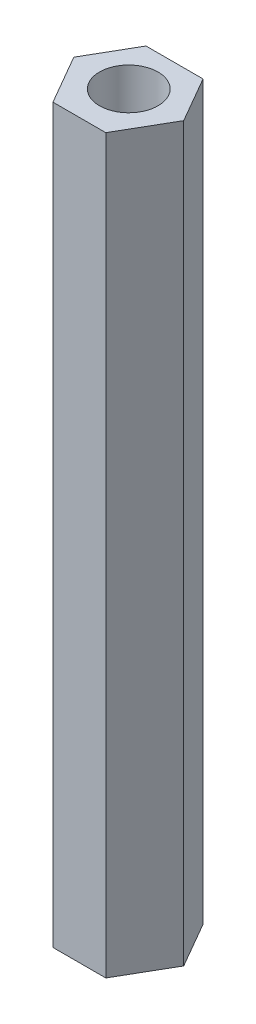
ISO-10303-21;
HEADER;
FILE_DESCRIPTION(('STEP AP214'),'2;1');
FILE_NAME('part.step','',(''),(''),'','','');
FILE_SCHEMA(('AUTOMOTIVE_DESIGN { 1 0 10303 214 1 1 1 1 }'));
ENDSEC;
DATA;
#1=APPLICATION_CONTEXT('core data for automotive mechanical design processes');
#2=APPLICATION_PROTOCOL_DEFINITION('international standard','automotive_design',2000,#1);
#3=PRODUCT_CONTEXT('',#1,'mechanical');
#4=PRODUCT('Part','Part','',(#3));
#5=PRODUCT_RELATED_PRODUCT_CATEGORY('part','',(#4));
#6=PRODUCT_DEFINITION_FORMATION('','',#4);
#7=PRODUCT_DEFINITION_CONTEXT('part definition',#1,'design');
#8=PRODUCT_DEFINITION('design','',#6,#7);
#9=PRODUCT_DEFINITION_SHAPE('','',#8);
#10=(LENGTH_UNIT() NAMED_UNIT(*) SI_UNIT(.MILLI.,.METRE.));
#11=(NAMED_UNIT(*) PLANE_ANGLE_UNIT() SI_UNIT($,.RADIAN.));
#12=(NAMED_UNIT(*) SI_UNIT($,.STERADIAN.) SOLID_ANGLE_UNIT());
#13=UNCERTAINTY_MEASURE_WITH_UNIT(LENGTH_MEASURE(1.E-05),#10,'distance_accuracy_value','');
#14=(GEOMETRIC_REPRESENTATION_CONTEXT(3) GLOBAL_UNCERTAINTY_ASSIGNED_CONTEXT((#13)) GLOBAL_UNIT_ASSIGNED_CONTEXT((#10,
#11,#12)) REPRESENTATION_CONTEXT('',''));
#15=CARTESIAN_POINT('',(0.,0.,0.));
#16=DIRECTION('',(0.,0.,1.));
#17=DIRECTION('',(1.,0.,0.));
#18=AXIS2_PLACEMENT_3D('',#15,#16,#17);
#19=CARTESIAN_POINT('',(0.,100.,0.));
#20=DIRECTION('',(0.,-1.,0.));
#21=DIRECTION('',(0.,0.,-1.));
#22=AXIS2_PLACEMENT_3D('',#19,#20,#21);
#23=PLANE('',#22);
#24=DIRECTION('',(-0.499999999999998,0.,0.86602540378444));
#25=VECTOR('',#24,1.);
#26=CARTESIAN_POINT('',(-6.61045846071364,100.,0.947169106116247));
#27=LINE('',#26,#25);
#28=CARTESIAN_POINT('',(-3.00042006965135,100.,-5.30560080447787));
#29=VERTEX_POINT('',#28);
#30=CARTESIAN_POINT('',(-6.61045846071364,100.,0.947169106116247));
#31=VERTEX_POINT('',#30);
#32=EDGE_CURVE('E132',#29,#31,#27,.T.);
#33=ORIENTED_EDGE('',*,*,#32,.T.);
#34=DIRECTION('',(0.500000000000004,0.,0.866025403784436));
#35=VECTOR('',#34,1.);
#36=CARTESIAN_POINT('',(-2.71494335231076,100.,7.69439919552213));
#37=LINE('',#36,#35);
#38=CARTESIAN_POINT('',(-2.71494335231076,100.,7.69439919552213));
#39=VERTEX_POINT('',#38);
#40=EDGE_CURVE('E90',#31,#39,#37,.T.);
#41=ORIENTED_EDGE('',*,*,#40,.T.);
#42=DIRECTION('',(1.,0.,0.));
#43=VECTOR('',#42,1.);
#44=CARTESIAN_POINT('',(4.50513342981381,100.,7.69439919552213));
#45=LINE('',#44,#43);
#46=CARTESIAN_POINT('',(4.50513342981381,100.,7.69439919552213));
#47=VERTEX_POINT('',#46);
#48=EDGE_CURVE('E103',#39,#47,#45,.T.);
#49=ORIENTED_EDGE('',*,*,#48,.T.);
#50=DIRECTION('',(0.499999999999998,0.,-0.86602540378444));
#51=VECTOR('',#50,1.);
#52=CARTESIAN_POINT('',(8.40064853821664,100.,0.94716910611619));
#53=LINE('',#52,#51);
#54=CARTESIAN_POINT('',(8.40064853821664,100.,0.94716910611619));
#55=VERTEX_POINT('',#54);
#56=EDGE_CURVE('E97',#47,#55,#53,.T.);
#57=ORIENTED_EDGE('',*,*,#56,.T.);
#58=DIRECTION('',(-0.500000000000005,0.,-0.866025403784436));
#59=VECTOR('',#58,1.);
#60=CARTESIAN_POINT('',(4.79061014715433,100.,-5.30560080447787));
#61=LINE('',#60,#59);
#62=CARTESIAN_POINT('',(4.79061014715433,100.,-5.30560080447787));
#63=VERTEX_POINT('',#62);
#64=EDGE_CURVE('E101',#55,#63,#61,.T.);
#65=ORIENTED_EDGE('',*,*,#64,.T.);
#66=DIRECTION('',(-1.,0.,0.));
#67=VECTOR('',#66,1.);
#68=CARTESIAN_POINT('',(-3.00042006965135,100.,-5.30560080447787));
#69=LINE('',#68,#67);
#70=EDGE_CURVE('E53',#63,#29,#69,.T.);
#71=ORIENTED_EDGE('',*,*,#70,.T.);
#72=EDGE_LOOP('',(#33,#41,#49,#57,#65,#71));
#73=FACE_BOUND('',#72,.T.);
#74=CARTESIAN_POINT('',(0.895095038751468,100.,0.947169106116239));
#75=DIRECTION('',(0.,1.,0.));
#76=DIRECTION('',(0.,0.,1.));
#77=AXIS2_PLACEMENT_3D('',#74,#75,#76);
#78=CIRCLE('',#77,4.);
#79=CARTESIAN_POINT('',(0.895095038751468,100.,4.94716910611624));
#80=VERTEX_POINT('',#79);
#81=EDGE_CURVE('E125',#80,#80,#78,.T.);
#82=ORIENTED_EDGE('',*,*,#81,.F.);
#83=EDGE_LOOP('',(#82));
#84=FACE_BOUND('',#83,.T.);
#85=ADVANCED_FACE('F36',(#73,#84),#23,.F.);
#86=CARTESIAN_POINT('',(0.,0.,0.));
#87=DIRECTION('',(0.,-1.,0.));
#88=DIRECTION('',(0.,0.,-1.));
#89=AXIS2_PLACEMENT_3D('',#86,#87,#88);
#90=PLANE('',#89);
#91=DIRECTION('',(-0.499999999999998,0.,0.86602540378444));
#92=VECTOR('',#91,1.);
#93=CARTESIAN_POINT('',(-6.61045846071364,0.,0.947169106116247));
#94=LINE('',#93,#92);
#95=CARTESIAN_POINT('',(-3.00042006965135,0.,-5.30560080447787));
#96=VERTEX_POINT('',#95);
#97=CARTESIAN_POINT('',(-6.61045846071364,0.,0.947169106116247));
#98=VERTEX_POINT('',#97);
#99=EDGE_CURVE('E121',#96,#98,#94,.T.);
#100=ORIENTED_EDGE('',*,*,#99,.F.);
#101=DIRECTION('',(-1.,0.,0.));
#102=VECTOR('',#101,1.);
#103=CARTESIAN_POINT('',(-3.00042006965135,0.,-5.30560080447787));
#104=LINE('',#103,#102);
#105=CARTESIAN_POINT('',(4.79061014715433,0.,-5.30560080447787));
#106=VERTEX_POINT('',#105);
#107=EDGE_CURVE('E82',#106,#96,#104,.T.);
#108=ORIENTED_EDGE('',*,*,#107,.F.);
#109=DIRECTION('',(-0.500000000000005,0.,-0.866025403784436));
#110=VECTOR('',#109,1.);
#111=CARTESIAN_POINT('',(4.79061014715433,0.,-5.30560080447787));
#112=LINE('',#111,#110);
#113=CARTESIAN_POINT('',(8.40064853821664,0.,0.94716910611619));
#114=VERTEX_POINT('',#113);
#115=EDGE_CURVE('E76',#114,#106,#112,.T.);
#116=ORIENTED_EDGE('',*,*,#115,.F.);
#117=DIRECTION('',(0.499999999999998,0.,-0.86602540378444));
#118=VECTOR('',#117,1.);
#119=CARTESIAN_POINT('',(8.40064853821664,0.,0.94716910611619));
#120=LINE('',#119,#118);
#121=CARTESIAN_POINT('',(4.50513342981381,0.,7.69439919552213));
#122=VERTEX_POINT('',#121);
#123=EDGE_CURVE('E111',#122,#114,#120,.T.);
#124=ORIENTED_EDGE('',*,*,#123,.F.);
#125=DIRECTION('',(1.,0.,0.));
#126=VECTOR('',#125,1.);
#127=CARTESIAN_POINT('',(4.50513342981381,0.,7.69439919552213));
#128=LINE('',#127,#126);
#129=CARTESIAN_POINT('',(-2.71494335231076,0.,7.69439919552213));
#130=VERTEX_POINT('',#129);
#131=EDGE_CURVE('E127',#130,#122,#128,.T.);
#132=ORIENTED_EDGE('',*,*,#131,.F.);
#133=DIRECTION('',(0.500000000000004,0.,0.866025403784436));
#134=VECTOR('',#133,1.);
#135=CARTESIAN_POINT('',(-2.71494335231076,0.,7.69439919552213));
#136=LINE('',#135,#134);
#137=EDGE_CURVE('E124',#98,#130,#136,.T.);
#138=ORIENTED_EDGE('',*,*,#137,.F.);
#139=EDGE_LOOP('',(#100,#108,#116,#124,#132,#138));
#140=FACE_BOUND('',#139,.T.);
#141=CARTESIAN_POINT('',(0.895095038751468,0.,0.947169106116239));
#142=DIRECTION('',(0.,1.,0.));
#143=DIRECTION('',(0.,0.,1.));
#144=AXIS2_PLACEMENT_3D('',#141,#142,#143);
#145=CIRCLE('',#144,4.);
#146=CARTESIAN_POINT('',(0.895095038751468,0.,4.94716910611624));
#147=VERTEX_POINT('',#146);
#148=EDGE_CURVE('E225',#147,#147,#145,.T.);
#149=ORIENTED_EDGE('',*,*,#148,.T.);
#150=EDGE_LOOP('',(#149));
#151=FACE_BOUND('',#150,.T.);
#152=ADVANCED_FACE('F141',(#140,#151),#90,.T.);
#153=CARTESIAN_POINT('',(-6.61045846071364,100.,0.947169106116247));
#154=DIRECTION('',(0.86602540378444,0.,0.499999999999998));
#155=DIRECTION('',(0.499999999999998,0.,-0.86602540378444));
#156=AXIS2_PLACEMENT_3D('',#153,#154,#155);
#157=PLANE('',#156);
#158=ORIENTED_EDGE('',*,*,#99,.T.);
#159=DIRECTION('',(0.,-1.,0.));
#160=VECTOR('',#159,1.);
#161=CARTESIAN_POINT('',(-6.61045846071364,100.,0.947169106116247));
#162=LINE('',#161,#160);
#163=EDGE_CURVE('E11',#31,#98,#162,.T.);
#164=ORIENTED_EDGE('',*,*,#163,.F.);
#165=ORIENTED_EDGE('',*,*,#32,.F.);
#166=DIRECTION('',(0.,-1.,0.));
#167=VECTOR('',#166,1.);
#168=CARTESIAN_POINT('',(-3.00042006965135,100.,-5.30560080447787));
#169=LINE('',#168,#167);
#170=EDGE_CURVE('E117',#29,#96,#169,.T.);
#171=ORIENTED_EDGE('',*,*,#170,.T.);
#172=EDGE_LOOP('',(#158,#164,#165,#171));
#173=FACE_BOUND('',#172,.T.);
#174=ADVANCED_FACE('F38',(#173),#157,.F.);
#175=CARTESIAN_POINT('',(-2.71494335231076,100.,7.69439919552213));
#176=DIRECTION('',(0.866025403784436,0.,-0.500000000000004));
#177=DIRECTION('',(-0.500000000000004,0.,-0.866025403784436));
#178=AXIS2_PLACEMENT_3D('',#175,#176,#177);
#179=PLANE('',#178);
#180=ORIENTED_EDGE('',*,*,#137,.T.);
#181=DIRECTION('',(0.,-1.,0.));
#182=VECTOR('',#181,1.);
#183=CARTESIAN_POINT('',(-2.71494335231076,100.,7.69439919552213));
#184=LINE('',#183,#182);
#185=EDGE_CURVE('E45',#39,#130,#184,.T.);
#186=ORIENTED_EDGE('',*,*,#185,.F.);
#187=ORIENTED_EDGE('',*,*,#40,.F.);
#188=ORIENTED_EDGE('',*,*,#163,.T.);
#189=EDGE_LOOP('',(#180,#186,#187,#188));
#190=FACE_BOUND('',#189,.T.);
#191=ADVANCED_FACE('F166',(#190),#179,.F.);
#192=CARTESIAN_POINT('',(4.50513342981381,100.,7.69439919552213));
#193=DIRECTION('',(0.,0.,-1.));
#194=DIRECTION('',(-1.,0.,0.));
#195=AXIS2_PLACEMENT_3D('',#192,#193,#194);
#196=PLANE('',#195);
#197=ORIENTED_EDGE('',*,*,#131,.T.);
#198=DIRECTION('',(0.,-1.,0.));
#199=VECTOR('',#198,1.);
#200=CARTESIAN_POINT('',(4.50513342981381,100.,7.69439919552213));
#201=LINE('',#200,#199);
#202=EDGE_CURVE('E112',#47,#122,#201,.T.);
#203=ORIENTED_EDGE('',*,*,#202,.F.);
#204=ORIENTED_EDGE('',*,*,#48,.F.);
#205=ORIENTED_EDGE('',*,*,#185,.T.);
#206=EDGE_LOOP('',(#197,#203,#204,#205));
#207=FACE_BOUND('',#206,.T.);
#208=ADVANCED_FACE('F138',(#207),#196,.F.);
#209=CARTESIAN_POINT('',(8.40064853821664,100.,0.94716910611619));
#210=DIRECTION('',(-0.86602540378444,0.,-0.499999999999998));
#211=DIRECTION('',(-0.499999999999998,0.,0.86602540378444));
#212=AXIS2_PLACEMENT_3D('',#209,#210,#211);
#213=PLANE('',#212);
#214=ORIENTED_EDGE('',*,*,#123,.T.);
#215=DIRECTION('',(0.,-1.,0.));
#216=VECTOR('',#215,1.);
#217=CARTESIAN_POINT('',(8.40064853821664,100.,0.94716910611619));
#218=LINE('',#217,#216);
#219=EDGE_CURVE('E108',#55,#114,#218,.T.);
#220=ORIENTED_EDGE('',*,*,#219,.F.);
#221=ORIENTED_EDGE('',*,*,#56,.F.);
#222=ORIENTED_EDGE('',*,*,#202,.T.);
#223=EDGE_LOOP('',(#214,#220,#221,#222));
#224=FACE_BOUND('',#223,.T.);
#225=ADVANCED_FACE('F109',(#224),#213,.F.);
#226=CARTESIAN_POINT('',(4.79061014715433,100.,-5.30560080447787));
#227=DIRECTION('',(-0.866025403784436,0.,0.500000000000005));
#228=DIRECTION('',(0.500000000000005,0.,0.866025403784436));
#229=AXIS2_PLACEMENT_3D('',#226,#227,#228);
#230=PLANE('',#229);
#231=ORIENTED_EDGE('',*,*,#115,.T.);
#232=DIRECTION('',(0.,-1.,0.));
#233=VECTOR('',#232,1.);
#234=CARTESIAN_POINT('',(4.79061014715433,100.,-5.30560080447787));
#235=LINE('',#234,#233);
#236=EDGE_CURVE('E113',#63,#106,#235,.T.);
#237=ORIENTED_EDGE('',*,*,#236,.F.);
#238=ORIENTED_EDGE('',*,*,#64,.F.);
#239=ORIENTED_EDGE('',*,*,#219,.T.);
#240=EDGE_LOOP('',(#231,#237,#238,#239));
#241=FACE_BOUND('',#240,.T.);
#242=ADVANCED_FACE('F115',(#241),#230,.F.);
#243=CARTESIAN_POINT('',(-3.00042006965135,100.,-5.30560080447787));
#244=DIRECTION('',(0.,0.,1.));
#245=DIRECTION('',(1.,0.,0.));
#246=AXIS2_PLACEMENT_3D('',#243,#244,#245);
#247=PLANE('',#246);
#248=ORIENTED_EDGE('',*,*,#107,.T.);
#249=ORIENTED_EDGE('',*,*,#170,.F.);
#250=ORIENTED_EDGE('',*,*,#70,.F.);
#251=ORIENTED_EDGE('',*,*,#236,.T.);
#252=EDGE_LOOP('',(#248,#249,#250,#251));
#253=FACE_BOUND('',#252,.T.);
#254=ADVANCED_FACE('F146',(#253),#247,.F.);
#255=CARTESIAN_POINT('',(0.895095038751468,100.,0.947169106116239));
#256=DIRECTION('',(0.,-1.,0.));
#257=DIRECTION('',(0.,0.,-1.));
#258=AXIS2_PLACEMENT_3D('',#255,#256,#257);
#259=CYLINDRICAL_SURFACE('',#258,4.);
#260=ORIENTED_EDGE('',*,*,#81,.T.);
#261=EDGE_LOOP('',(#260));
#262=FACE_BOUND('',#261,.T.);
#263=ORIENTED_EDGE('',*,*,#148,.F.);
#264=EDGE_LOOP('',(#263));
#265=FACE_BOUND('',#264,.T.);
#266=ADVANCED_FACE('F148',(#262,#265),#259,.F.);
#267=CLOSED_SHELL('',(#85,#152,#174,#191,#208,#225,#242,#254,#266));
#268=MANIFOLD_SOLID_BREP('B2',#267);
#269=ADVANCED_BREP_SHAPE_REPRESENTATION('',(#18,#268),#14);
#270=SHAPE_DEFINITION_REPRESENTATION(#9,#269);
ENDSEC;
END-ISO-10303-21;
